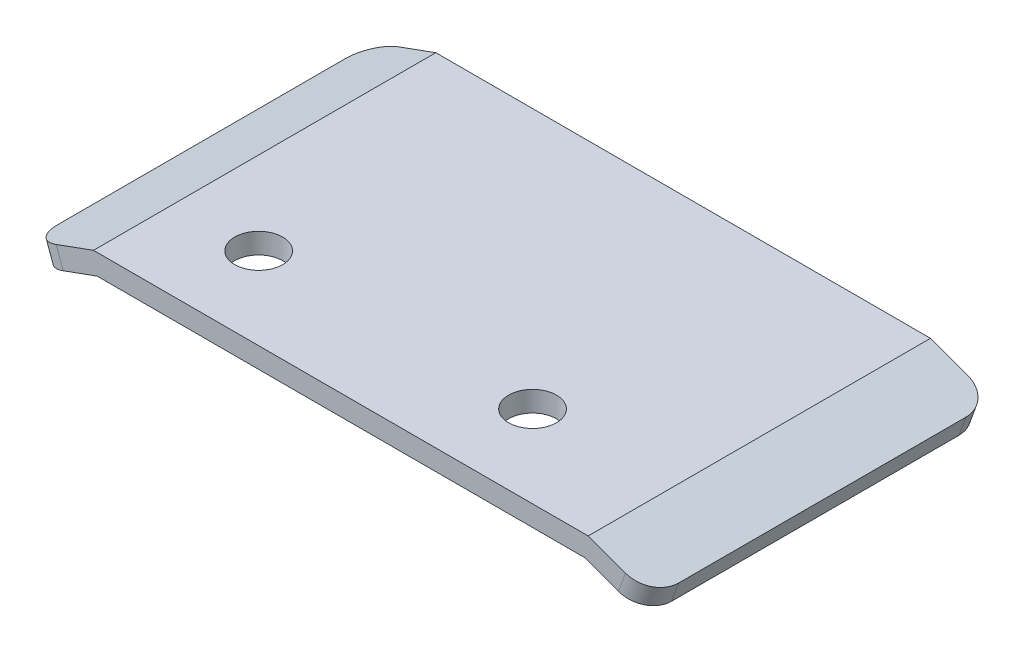
ISO-10303-21;
HEADER;
FILE_DESCRIPTION(('STEP AP214'),'2;1');
FILE_NAME('part.step','',(''),(''),'','','');
FILE_SCHEMA(('AUTOMOTIVE_DESIGN { 1 0 10303 214 1 1 1 1 }'));
ENDSEC;
DATA;
#1=APPLICATION_CONTEXT('core data for automotive mechanical design processes');
#2=APPLICATION_PROTOCOL_DEFINITION('international standard','automotive_design',2000,#1);
#3=PRODUCT_CONTEXT('',#1,'mechanical');
#4=PRODUCT('Part','Part','',(#3));
#5=PRODUCT_RELATED_PRODUCT_CATEGORY('part','',(#4));
#6=PRODUCT_DEFINITION_FORMATION('','',#4);
#7=PRODUCT_DEFINITION_CONTEXT('part definition',#1,'design');
#8=PRODUCT_DEFINITION('design','',#6,#7);
#9=PRODUCT_DEFINITION_SHAPE('','',#8);
#10=(LENGTH_UNIT() NAMED_UNIT(*) SI_UNIT(.MILLI.,.METRE.));
#11=(NAMED_UNIT(*) PLANE_ANGLE_UNIT() SI_UNIT($,.RADIAN.));
#12=(NAMED_UNIT(*) SI_UNIT($,.STERADIAN.) SOLID_ANGLE_UNIT());
#13=UNCERTAINTY_MEASURE_WITH_UNIT(LENGTH_MEASURE(1.E-05),#10,'distance_accuracy_value','');
#14=(GEOMETRIC_REPRESENTATION_CONTEXT(3) GLOBAL_UNCERTAINTY_ASSIGNED_CONTEXT((#13)) GLOBAL_UNIT_ASSIGNED_CONTEXT((#10,
#11,#12)) REPRESENTATION_CONTEXT('',''));
#15=CARTESIAN_POINT('',(0.,0.,0.));
#16=DIRECTION('',(0.,0.,1.));
#17=DIRECTION('',(1.,0.,0.));
#18=AXIS2_PLACEMENT_3D('',#15,#16,#17);
#19=CARTESIAN_POINT('',(-19.6015949538531,4.27295140546506,25.));
#20=DIRECTION('',(0.939692620785908,0.342020143325669,0.));
#21=DIRECTION('',(-0.342020143325669,0.939692620785908,0.));
#22=AXIS2_PLACEMENT_3D('',#19,#20,#21);
#23=PLANE('',#22);
#24=DIRECTION('',(0.,0.,-1.));
#25=VECTOR('',#24,1.);
#26=CARTESIAN_POINT('',(-19.6015949538531,4.27295140546506,25.));
#27=LINE('',#26,#25);
#28=CARTESIAN_POINT('',(-19.6015949538531,4.27295140546506,23.));
#29=VERTEX_POINT('',#28);
#30=CARTESIAN_POINT('',(-19.6015949538531,4.27295140546506,2.));
#31=VERTEX_POINT('',#30);
#32=EDGE_CURVE('E160',#29,#31,#27,.T.);
#33=ORIENTED_EDGE('',*,*,#32,.T.);
#34=DIRECTION('',(0.342020143325669,-0.939692620785908,0.));
#35=VECTOR('',#34,1.);
#36=CARTESIAN_POINT('',(-19.6015949538531,4.27295140546506,2.));
#37=LINE('',#36,#35);
#38=CARTESIAN_POINT('',(-19.0885647388646,2.8634124742862,2.));
#39=VERTEX_POINT('',#38);
#40=EDGE_CURVE('E210',#31,#39,#37,.T.);
#41=ORIENTED_EDGE('',*,*,#40,.T.);
#42=DIRECTION('',(0.,0.,-1.));
#43=VECTOR('',#42,1.);
#44=CARTESIAN_POINT('',(-19.0885647388646,2.8634124742862,25.));
#45=LINE('',#44,#43);
#46=CARTESIAN_POINT('',(-19.0885647388646,2.8634124742862,23.));
#47=VERTEX_POINT('',#46);
#48=EDGE_CURVE('E143',#47,#39,#45,.T.);
#49=ORIENTED_EDGE('',*,*,#48,.F.);
#50=DIRECTION('',(0.342020143325669,-0.939692620785908,0.));
#51=VECTOR('',#50,1.);
#52=CARTESIAN_POINT('',(-19.6015949538531,4.27295140546506,23.));
#53=LINE('',#52,#51);
#54=EDGE_CURVE('E53',#47,#29,#53,.F.);
#55=ORIENTED_EDGE('',*,*,#54,.T.);
#56=EDGE_LOOP('',(#33,#41,#49,#55));
#57=FACE_BOUND('',#56,.T.);
#58=ADVANCED_FACE('F33',(#57),#23,.F.);
#59=CARTESIAN_POINT('',(-19.0885647388646,2.8634124742862,25.));
#60=DIRECTION('',(-0.34202014332567,0.939692620785908,0.));
#61=DIRECTION('',(-0.939692620785908,-0.34202014332567,0.));
#62=AXIS2_PLACEMENT_3D('',#59,#60,#61);
#63=PLANE('',#62);
#64=ORIENTED_EDGE('',*,*,#48,.T.);
#65=CARTESIAN_POINT('',(-17.2091794972928,3.54745276093754,2.));
#66=DIRECTION('',(-0.34202014332567,0.939692620785908,0.));
#67=DIRECTION('',(-0.939692620785908,-0.34202014332567,0.));
#68=AXIS2_PLACEMENT_3D('',#65,#66,#67);
#69=CIRCLE('',#68,2.);
#70=CARTESIAN_POINT('',(-17.2091794972928,3.54745276093754,0.));
#71=VERTEX_POINT('',#70);
#72=EDGE_CURVE('E215',#39,#71,#69,.F.);
#73=ORIENTED_EDGE('',*,*,#72,.T.);
#74=DIRECTION('',(0.939692620785908,0.34202014332567,0.));
#75=VECTOR('',#74,1.);
#76=CARTESIAN_POINT('',(-19.0885647388646,2.8634124742862,0.));
#77=LINE('',#76,#75);
#78=CARTESIAN_POINT('',(-14.7326106409394,4.44885010776084,0.));
#79=VERTEX_POINT('',#78);
#80=EDGE_CURVE('E140',#71,#79,#77,.T.);
#81=ORIENTED_EDGE('',*,*,#80,.T.);
#82=DIRECTION('',(0.,0.,-1.));
#83=VECTOR('',#82,1.);
#84=CARTESIAN_POINT('',(-14.7326106409394,4.44885010776084,25.));
#85=LINE('',#84,#83);
#86=CARTESIAN_POINT('',(-14.7326106409394,4.44885010776084,25.));
#87=VERTEX_POINT('',#86);
#88=EDGE_CURVE('E136',#87,#79,#85,.T.);
#89=ORIENTED_EDGE('',*,*,#88,.F.);
#90=DIRECTION('',(0.939692620785908,0.34202014332567,0.));
#91=VECTOR('',#90,1.);
#92=CARTESIAN_POINT('',(-19.0885647388646,2.8634124742862,25.));
#93=LINE('',#92,#91);
#94=CARTESIAN_POINT('',(-17.2091794972928,3.54745276093754,25.));
#95=VERTEX_POINT('',#94);
#96=EDGE_CURVE('E122',#95,#87,#93,.T.);
#97=ORIENTED_EDGE('',*,*,#96,.F.);
#98=CARTESIAN_POINT('',(-17.2091794972928,3.54745276093754,23.));
#99=DIRECTION('',(-0.34202014332567,0.939692620785908,0.));
#100=DIRECTION('',(-0.939692620785908,-0.34202014332567,0.));
#101=AXIS2_PLACEMENT_3D('',#98,#99,#100);
#102=CIRCLE('',#101,2.);
#103=EDGE_CURVE('E213',#95,#47,#102,.F.);
#104=ORIENTED_EDGE('',*,*,#103,.T.);
#105=EDGE_LOOP('',(#64,#73,#81,#89,#97,#104));
#106=FACE_BOUND('',#105,.T.);
#107=ADVANCED_FACE('F138',(#106),#63,.F.);
#108=CARTESIAN_POINT('',(-14.7326106409394,4.44885010776084,25.));
#109=DIRECTION('',(0.,1.,0.));
#110=DIRECTION('',(-1.,0.,0.));
#111=AXIS2_PLACEMENT_3D('',#108,#109,#110);
#112=PLANE('',#111);
#113=CARTESIAN_POINT('',(11.0673893590606,4.44885010776085,19.));
#114=DIRECTION('',(0.,-1.,0.));
#115=DIRECTION('',(1.,0.,0.));
#116=AXIS2_PLACEMENT_3D('',#113,#114,#115);
#117=CIRCLE('',#116,1.75);
#118=CARTESIAN_POINT('',(12.8173893590606,4.44885010776085,19.));
#119=VERTEX_POINT('',#118);
#120=EDGE_CURVE('E391',#119,#119,#117,.T.);
#121=ORIENTED_EDGE('',*,*,#120,.F.);
#122=EDGE_LOOP('',(#121));
#123=FACE_BOUND('',#122,.T.);
#124=CARTESIAN_POINT('',(-8.93261064093942,4.44885010776084,19.));
#125=DIRECTION('',(0.,-1.,0.));
#126=DIRECTION('',(1.,0.,0.));
#127=AXIS2_PLACEMENT_3D('',#124,#125,#126);
#128=CIRCLE('',#127,1.75);
#129=CARTESIAN_POINT('',(-7.18261064093942,4.44885010776084,19.));
#130=VERTEX_POINT('',#129);
#131=EDGE_CURVE('E394',#130,#130,#128,.T.);
#132=ORIENTED_EDGE('',*,*,#131,.F.);
#133=EDGE_LOOP('',(#132));
#134=FACE_BOUND('',#133,.T.);
#135=DIRECTION('',(1.,0.,0.));
#136=VECTOR('',#135,1.);
#137=CARTESIAN_POINT('',(-14.7326106409394,4.44885010776084,0.));
#138=LINE('',#137,#136);
#139=CARTESIAN_POINT('',(20.8673893590606,4.44885010776085,0.));
#140=VERTEX_POINT('',#139);
#141=EDGE_CURVE('E162',#79,#140,#138,.T.);
#142=ORIENTED_EDGE('',*,*,#141,.T.);
#143=DIRECTION('',(0.,0.,-1.));
#144=VECTOR('',#143,1.);
#145=CARTESIAN_POINT('',(20.8673893590606,4.44885010776085,25.));
#146=LINE('',#145,#144);
#147=CARTESIAN_POINT('',(20.8673893590606,4.44885010776085,25.));
#148=VERTEX_POINT('',#147);
#149=EDGE_CURVE('E144',#148,#140,#146,.T.);
#150=ORIENTED_EDGE('',*,*,#149,.F.);
#151=DIRECTION('',(1.,0.,0.));
#152=VECTOR('',#151,1.);
#153=CARTESIAN_POINT('',(-14.7326106409394,4.44885010776084,25.));
#154=LINE('',#153,#152);
#155=EDGE_CURVE('E127',#87,#148,#154,.T.);
#156=ORIENTED_EDGE('',*,*,#155,.F.);
#157=ORIENTED_EDGE('',*,*,#88,.T.);
#158=EDGE_LOOP('',(#142,#150,#156,#157));
#159=FACE_BOUND('',#158,.T.);
#160=ADVANCED_FACE('F146',(#123,#134,#159),#112,.F.);
#161=CARTESIAN_POINT('',(20.8673893590606,4.44885010776085,25.));
#162=DIRECTION('',(0.34202014332567,0.939692620785908,0.));
#163=DIRECTION('',(-0.939692620785908,0.34202014332567,0.));
#164=AXIS2_PLACEMENT_3D('',#161,#162,#163);
#165=PLANE('',#164);
#166=DIRECTION('',(0.,0.,-1.));
#167=VECTOR('',#166,1.);
#168=CARTESIAN_POINT('',(25.2233434569857,2.8634124742862,25.));
#169=LINE('',#168,#167);
#170=CARTESIAN_POINT('',(25.2233434569857,2.8634124742862,23.));
#171=VERTEX_POINT('',#170);
#172=CARTESIAN_POINT('',(25.2233434569857,2.8634124742862,2.));
#173=VERTEX_POINT('',#172);
#174=EDGE_CURVE('E183',#171,#173,#169,.T.);
#175=ORIENTED_EDGE('',*,*,#174,.F.);
#176=CARTESIAN_POINT('',(23.3439582154139,3.54745276093754,23.));
#177=DIRECTION('',(0.34202014332567,0.939692620785908,0.));
#178=DIRECTION('',(-0.939692620785908,0.34202014332567,0.));
#179=AXIS2_PLACEMENT_3D('',#176,#177,#178);
#180=CIRCLE('',#179,2.);
#181=CARTESIAN_POINT('',(23.3439582154139,3.54745276093754,25.));
#182=VERTEX_POINT('',#181);
#183=EDGE_CURVE('E203',#171,#182,#180,.F.);
#184=ORIENTED_EDGE('',*,*,#183,.T.);
#185=DIRECTION('',(0.939692620785908,-0.34202014332567,0.));
#186=VECTOR('',#185,1.);
#187=CARTESIAN_POINT('',(20.8673893590606,4.44885010776085,25.));
#188=LINE('',#187,#186);
#189=EDGE_CURVE('E149',#148,#182,#188,.T.);
#190=ORIENTED_EDGE('',*,*,#189,.F.);
#191=ORIENTED_EDGE('',*,*,#149,.T.);
#192=DIRECTION('',(0.939692620785908,-0.34202014332567,0.));
#193=VECTOR('',#192,1.);
#194=CARTESIAN_POINT('',(20.8673893590606,4.44885010776085,0.));
#195=LINE('',#194,#193);
#196=CARTESIAN_POINT('',(23.3439582154139,3.54745276093754,0.));
#197=VERTEX_POINT('',#196);
#198=EDGE_CURVE('E165',#140,#197,#195,.T.);
#199=ORIENTED_EDGE('',*,*,#198,.T.);
#200=CARTESIAN_POINT('',(23.3439582154139,3.54745276093754,2.));
#201=DIRECTION('',(0.34202014332567,0.939692620785908,0.));
#202=DIRECTION('',(-0.939692620785908,0.34202014332567,0.));
#203=AXIS2_PLACEMENT_3D('',#200,#201,#202);
#204=CIRCLE('',#203,2.);
#205=EDGE_CURVE('E201',#197,#173,#204,.F.);
#206=ORIENTED_EDGE('',*,*,#205,.T.);
#207=EDGE_LOOP('',(#175,#184,#190,#191,#199,#206));
#208=FACE_BOUND('',#207,.T.);
#209=ADVANCED_FACE('F233',(#208),#165,.F.);
#210=CARTESIAN_POINT('',(25.7363736719742,4.27295140546506,25.));
#211=DIRECTION('',(-0.939692620785909,0.342020143325667,0.));
#212=DIRECTION('',(-0.342020143325667,-0.939692620785909,0.));
#213=AXIS2_PLACEMENT_3D('',#210,#211,#212);
#214=PLANE('',#213);
#215=DIRECTION('',(0.,0.,-1.));
#216=VECTOR('',#215,1.);
#217=CARTESIAN_POINT('',(25.7363736719742,4.27295140546506,25.));
#218=LINE('',#217,#216);
#219=CARTESIAN_POINT('',(25.7363736719742,4.27295140546506,23.));
#220=VERTEX_POINT('',#219);
#221=CARTESIAN_POINT('',(25.7363736719742,4.27295140546506,2.));
#222=VERTEX_POINT('',#221);
#223=EDGE_CURVE('E180',#220,#222,#218,.T.);
#224=ORIENTED_EDGE('',*,*,#223,.F.);
#225=DIRECTION('',(0.342020143325667,0.939692620785909,0.));
#226=VECTOR('',#225,1.);
#227=CARTESIAN_POINT('',(25.2233434569857,2.8634124742862,23.));
#228=LINE('',#227,#226);
#229=EDGE_CURVE('E199',#220,#171,#228,.F.);
#230=ORIENTED_EDGE('',*,*,#229,.T.);
#231=ORIENTED_EDGE('',*,*,#174,.T.);
#232=DIRECTION('',(0.342020143325667,0.939692620785909,0.));
#233=VECTOR('',#232,1.);
#234=CARTESIAN_POINT('',(25.7363736719742,4.27295140546506,2.));
#235=LINE('',#234,#233);
#236=EDGE_CURVE('E196',#173,#222,#235,.T.);
#237=ORIENTED_EDGE('',*,*,#236,.T.);
#238=EDGE_LOOP('',(#224,#230,#231,#237));
#239=FACE_BOUND('',#238,.T.);
#240=ADVANCED_FACE('F246',(#239),#214,.F.);
#241=CARTESIAN_POINT('',(21.1318798301233,5.94885010776085,25.));
#242=DIRECTION('',(-0.34202014332567,-0.939692620785908,0.));
#243=DIRECTION('',(0.939692620785908,-0.34202014332567,0.));
#244=AXIS2_PLACEMENT_3D('',#241,#242,#243);
#245=PLANE('',#244);
#246=DIRECTION('',(-0.939692620785908,0.34202014332567,0.));
#247=VECTOR('',#246,1.);
#248=CARTESIAN_POINT('',(21.1318798301233,5.94885010776085,25.));
#249=LINE('',#248,#247);
#250=CARTESIAN_POINT('',(23.8569884304024,4.9569916921164,25.));
#251=VERTEX_POINT('',#250);
#252=CARTESIAN_POINT('',(21.1318798301233,5.94885010776085,25.));
#253=VERTEX_POINT('',#252);
#254=EDGE_CURVE('E151',#251,#253,#249,.T.);
#255=ORIENTED_EDGE('',*,*,#254,.F.);
#256=CARTESIAN_POINT('',(23.8569884304024,4.9569916921164,23.));
#257=DIRECTION('',(-0.34202014332567,-0.939692620785908,0.));
#258=DIRECTION('',(0.939692620785908,-0.34202014332567,0.));
#259=AXIS2_PLACEMENT_3D('',#256,#257,#258);
#260=CIRCLE('',#259,2.);
#261=EDGE_CURVE('E194',#251,#220,#260,.F.);
#262=ORIENTED_EDGE('',*,*,#261,.T.);
#263=ORIENTED_EDGE('',*,*,#223,.T.);
#264=CARTESIAN_POINT('',(23.8569884304024,4.9569916921164,2.));
#265=DIRECTION('',(-0.34202014332567,-0.939692620785908,0.));
#266=DIRECTION('',(0.939692620785908,-0.34202014332567,0.));
#267=AXIS2_PLACEMENT_3D('',#264,#265,#266);
#268=CIRCLE('',#267,2.);
#269=CARTESIAN_POINT('',(23.8569884304024,4.9569916921164,0.));
#270=VERTEX_POINT('',#269);
#271=EDGE_CURVE('E192',#222,#270,#268,.F.);
#272=ORIENTED_EDGE('',*,*,#271,.T.);
#273=DIRECTION('',(-0.939692620785908,0.34202014332567,0.));
#274=VECTOR('',#273,1.);
#275=CARTESIAN_POINT('',(21.1318798301233,5.94885010776085,0.));
#276=LINE('',#275,#274);
#277=CARTESIAN_POINT('',(21.1318798301233,5.94885010776085,0.));
#278=VERTEX_POINT('',#277);
#279=EDGE_CURVE('E168',#270,#278,#276,.T.);
#280=ORIENTED_EDGE('',*,*,#279,.T.);
#281=DIRECTION('',(0.,0.,-1.));
#282=VECTOR('',#281,1.);
#283=CARTESIAN_POINT('',(21.1318798301233,5.94885010776085,25.));
#284=LINE('',#283,#282);
#285=EDGE_CURVE('E177',#253,#278,#284,.T.);
#286=ORIENTED_EDGE('',*,*,#285,.F.);
#287=EDGE_LOOP('',(#255,#262,#263,#272,#280,#286));
#288=FACE_BOUND('',#287,.T.);
#289=ADVANCED_FACE('F243',(#288),#245,.F.);
#290=CARTESIAN_POINT('',(-14.9971011120021,5.94885010776084,25.));
#291=DIRECTION('',(0.,-1.,0.));
#292=DIRECTION('',(1.,0.,0.));
#293=AXIS2_PLACEMENT_3D('',#290,#291,#292);
#294=PLANE('',#293);
#295=CARTESIAN_POINT('',(11.0673893590606,5.94885010776085,19.));
#296=DIRECTION('',(0.,-1.,0.));
#297=DIRECTION('',(1.,0.,0.));
#298=AXIS2_PLACEMENT_3D('',#295,#296,#297);
#299=CIRCLE('',#298,1.75);
#300=CARTESIAN_POINT('',(12.8173893590606,5.94885010776085,19.));
#301=VERTEX_POINT('',#300);
#302=EDGE_CURVE('E396',#301,#301,#299,.T.);
#303=ORIENTED_EDGE('',*,*,#302,.T.);
#304=EDGE_LOOP('',(#303));
#305=FACE_BOUND('',#304,.T.);
#306=CARTESIAN_POINT('',(-8.93261064093942,5.94885010776085,19.));
#307=DIRECTION('',(0.,-1.,0.));
#308=DIRECTION('',(1.,0.,0.));
#309=AXIS2_PLACEMENT_3D('',#306,#307,#308);
#310=CIRCLE('',#309,1.75);
#311=CARTESIAN_POINT('',(-7.18261064093942,5.94885010776085,19.));
#312=VERTEX_POINT('',#311);
#313=EDGE_CURVE('E163',#312,#312,#310,.T.);
#314=ORIENTED_EDGE('',*,*,#313,.T.);
#315=EDGE_LOOP('',(#314));
#316=FACE_BOUND('',#315,.T.);
#317=DIRECTION('',(-1.,0.,0.));
#318=VECTOR('',#317,1.);
#319=CARTESIAN_POINT('',(-14.9971011120021,5.94885010776084,0.));
#320=LINE('',#319,#318);
#321=CARTESIAN_POINT('',(-14.9971011120021,5.94885010776084,0.));
#322=VERTEX_POINT('',#321);
#323=EDGE_CURVE('E170',#278,#322,#320,.T.);
#324=ORIENTED_EDGE('',*,*,#323,.T.);
#325=DIRECTION('',(0.,0.,-1.));
#326=VECTOR('',#325,1.);
#327=CARTESIAN_POINT('',(-14.9971011120021,5.94885010776084,25.));
#328=LINE('',#327,#326);
#329=CARTESIAN_POINT('',(-14.9971011120021,5.94885010776084,25.));
#330=VERTEX_POINT('',#329);
#331=EDGE_CURVE('E174',#330,#322,#328,.T.);
#332=ORIENTED_EDGE('',*,*,#331,.F.);
#333=DIRECTION('',(-1.,0.,0.));
#334=VECTOR('',#333,1.);
#335=CARTESIAN_POINT('',(-14.9971011120021,5.94885010776084,25.));
#336=LINE('',#335,#334);
#337=EDGE_CURVE('E156',#253,#330,#336,.T.);
#338=ORIENTED_EDGE('',*,*,#337,.F.);
#339=ORIENTED_EDGE('',*,*,#285,.T.);
#340=EDGE_LOOP('',(#324,#332,#338,#339));
#341=FACE_BOUND('',#340,.T.);
#342=ADVANCED_FACE('F253',(#305,#316,#341),#294,.F.);
#343=CARTESIAN_POINT('',(-19.6015949538531,4.27295140546506,25.));
#344=DIRECTION('',(0.34202014332567,-0.939692620785908,0.));
#345=DIRECTION('',(0.939692620785908,0.34202014332567,0.));
#346=AXIS2_PLACEMENT_3D('',#343,#344,#345);
#347=PLANE('',#346);
#348=DIRECTION('',(-0.939692620785908,-0.34202014332567,0.));
#349=VECTOR('',#348,1.);
#350=CARTESIAN_POINT('',(-19.6015949538531,4.27295140546506,0.));
#351=LINE('',#350,#349);
#352=CARTESIAN_POINT('',(-17.7222097122813,4.9569916921164,0.));
#353=VERTEX_POINT('',#352);
#354=EDGE_CURVE('E133',#322,#353,#351,.T.);
#355=ORIENTED_EDGE('',*,*,#354,.T.);
#356=CARTESIAN_POINT('',(-17.7222097122813,4.9569916921164,2.));
#357=DIRECTION('',(0.34202014332567,-0.939692620785908,0.));
#358=DIRECTION('',(0.939692620785908,0.34202014332567,0.));
#359=AXIS2_PLACEMENT_3D('',#356,#357,#358);
#360=CIRCLE('',#359,2.);
#361=EDGE_CURVE('E11',#353,#31,#360,.F.);
#362=ORIENTED_EDGE('',*,*,#361,.T.);
#363=ORIENTED_EDGE('',*,*,#32,.F.);
#364=CARTESIAN_POINT('',(-17.7222097122813,4.9569916921164,23.));
#365=DIRECTION('',(0.34202014332567,-0.939692620785908,0.));
#366=DIRECTION('',(0.939692620785908,0.34202014332567,0.));
#367=AXIS2_PLACEMENT_3D('',#364,#365,#366);
#368=CIRCLE('',#367,2.);
#369=CARTESIAN_POINT('',(-17.7222097122813,4.9569916921164,25.));
#370=VERTEX_POINT('',#369);
#371=EDGE_CURVE('E41',#29,#370,#368,.F.);
#372=ORIENTED_EDGE('',*,*,#371,.T.);
#373=DIRECTION('',(-0.939692620785908,-0.34202014332567,0.));
#374=VECTOR('',#373,1.);
#375=CARTESIAN_POINT('',(-19.6015949538531,4.27295140546506,25.));
#376=LINE('',#375,#374);
#377=EDGE_CURVE('E158',#330,#370,#376,.T.);
#378=ORIENTED_EDGE('',*,*,#377,.F.);
#379=ORIENTED_EDGE('',*,*,#331,.T.);
#380=EDGE_LOOP('',(#355,#362,#363,#372,#378,#379));
#381=FACE_BOUND('',#380,.T.);
#382=ADVANCED_FACE('F218',(#381),#347,.F.);
#383=CARTESIAN_POINT('',(0.,0.,25.));
#384=DIRECTION('',(0.,0.,1.));
#385=DIRECTION('',(1.,0.,0.));
#386=AXIS2_PLACEMENT_3D('',#383,#384,#385);
#387=PLANE('',#386);
#388=ORIENTED_EDGE('',*,*,#189,.T.);
#389=DIRECTION('',(0.342020143325667,0.939692620785909,0.));
#390=VECTOR('',#389,1.);
#391=CARTESIAN_POINT('',(23.8569884304024,4.9569916921164,25.));
#392=LINE('',#391,#390);
#393=EDGE_CURVE('E189',#182,#251,#392,.T.);
#394=ORIENTED_EDGE('',*,*,#393,.T.);
#395=ORIENTED_EDGE('',*,*,#254,.T.);
#396=ORIENTED_EDGE('',*,*,#337,.T.);
#397=ORIENTED_EDGE('',*,*,#377,.T.);
#398=DIRECTION('',(0.342020143325669,-0.939692620785908,0.));
#399=VECTOR('',#398,1.);
#400=CARTESIAN_POINT('',(-17.2091794972928,3.54745276093754,25.));
#401=LINE('',#400,#399);
#402=EDGE_CURVE('E131',#370,#95,#401,.T.);
#403=ORIENTED_EDGE('',*,*,#402,.T.);
#404=ORIENTED_EDGE('',*,*,#96,.T.);
#405=ORIENTED_EDGE('',*,*,#155,.T.);
#406=EDGE_LOOP('',(#388,#394,#395,#396,#397,#403,#404,#405));
#407=FACE_BOUND('',#406,.T.);
#408=ADVANCED_FACE('F125',(#407),#387,.T.);
#409=CARTESIAN_POINT('',(0.,0.,0.));
#410=DIRECTION('',(0.,0.,1.));
#411=DIRECTION('',(1.,0.,0.));
#412=AXIS2_PLACEMENT_3D('',#409,#410,#411);
#413=PLANE('',#412);
#414=ORIENTED_EDGE('',*,*,#279,.F.);
#415=DIRECTION('',(0.342020143325667,0.939692620785909,0.));
#416=VECTOR('',#415,1.);
#417=CARTESIAN_POINT('',(19.4731045030272,-7.08763040785702,0.));
#418=LINE('',#417,#416);
#419=EDGE_CURVE('E207',#270,#197,#418,.F.);
#420=ORIENTED_EDGE('',*,*,#419,.T.);
#421=ORIENTED_EDGE('',*,*,#198,.F.);
#422=ORIENTED_EDGE('',*,*,#141,.F.);
#423=ORIENTED_EDGE('',*,*,#80,.F.);
#424=DIRECTION('',(0.342020143325669,-0.939692620785908,0.));
#425=VECTOR('',#424,1.);
#426=CARTESIAN_POINT('',(-14.055958570576,-5.11595053376858,0.));
#427=LINE('',#426,#425);
#428=EDGE_CURVE('E205',#71,#353,#427,.F.);
#429=ORIENTED_EDGE('',*,*,#428,.T.);
#430=ORIENTED_EDGE('',*,*,#354,.F.);
#431=ORIENTED_EDGE('',*,*,#323,.F.);
#432=EDGE_LOOP('',(#414,#420,#421,#422,#423,#429,#430,#431));
#433=FACE_BOUND('',#432,.T.);
#434=ADVANCED_FACE('F228',(#433),#413,.F.);
#435=CARTESIAN_POINT('',(-8.93261064093942,5.94885010776085,19.));
#436=DIRECTION('',(0.,-1.,0.));
#437=DIRECTION('',(1.,0.,0.));
#438=AXIS2_PLACEMENT_3D('',#435,#436,#437);
#439=CYLINDRICAL_SURFACE('',#438,1.75);
#440=ORIENTED_EDGE('',*,*,#313,.F.);
#441=EDGE_LOOP('',(#440));
#442=FACE_BOUND('',#441,.T.);
#443=ORIENTED_EDGE('',*,*,#131,.T.);
#444=EDGE_LOOP('',(#443));
#445=FACE_BOUND('',#444,.T.);
#446=ADVANCED_FACE('F310',(#442,#445),#439,.F.);
#447=CARTESIAN_POINT('',(11.0673893590606,5.94885010776085,19.));
#448=DIRECTION('',(0.,-1.,0.));
#449=DIRECTION('',(1.,0.,0.));
#450=AXIS2_PLACEMENT_3D('',#447,#448,#449);
#451=CYLINDRICAL_SURFACE('',#450,1.75);
#452=ORIENTED_EDGE('',*,*,#302,.F.);
#453=EDGE_LOOP('',(#452));
#454=FACE_BOUND('',#453,.T.);
#455=ORIENTED_EDGE('',*,*,#120,.T.);
#456=EDGE_LOOP('',(#455));
#457=FACE_BOUND('',#456,.T.);
#458=ADVANCED_FACE('F275',(#454,#457),#451,.F.);
#459=CARTESIAN_POINT('',(19.4731045030272,-7.08763040785702,23.));
#460=DIRECTION('',(-0.342020143325667,-0.939692620785909,0.));
#461=DIRECTION('',(0.939692620785909,-0.342020143325667,0.));
#462=AXIS2_PLACEMENT_3D('',#459,#460,#461);
#463=CYLINDRICAL_SURFACE('',#462,2.);
#464=ORIENTED_EDGE('',*,*,#183,.F.);
#465=ORIENTED_EDGE('',*,*,#229,.F.);
#466=ORIENTED_EDGE('',*,*,#261,.F.);
#467=ORIENTED_EDGE('',*,*,#393,.F.);
#468=EDGE_LOOP('',(#464,#465,#466,#467));
#469=FACE_BOUND('',#468,.T.);
#470=ADVANCED_FACE('F239',(#469),#463,.T.);
#471=CARTESIAN_POINT('',(23.8569884304024,4.9569916921164,2.));
#472=DIRECTION('',(0.342020143325667,0.939692620785909,0.));
#473=DIRECTION('',(-0.939692620785909,0.342020143325667,0.));
#474=AXIS2_PLACEMENT_3D('',#471,#472,#473);
#475=CYLINDRICAL_SURFACE('',#474,2.);
#476=ORIENTED_EDGE('',*,*,#205,.F.);
#477=ORIENTED_EDGE('',*,*,#419,.F.);
#478=ORIENTED_EDGE('',*,*,#271,.F.);
#479=ORIENTED_EDGE('',*,*,#236,.F.);
#480=EDGE_LOOP('',(#476,#477,#478,#479));
#481=FACE_BOUND('',#480,.T.);
#482=ADVANCED_FACE('F249',(#481),#475,.T.);
#483=CARTESIAN_POINT('',(-17.7222097122813,4.9569916921164,2.));
#484=DIRECTION('',(0.342020143325669,-0.939692620785908,0.));
#485=DIRECTION('',(0.939692620785908,0.342020143325669,0.));
#486=AXIS2_PLACEMENT_3D('',#483,#484,#485);
#487=CYLINDRICAL_SURFACE('',#486,2.);
#488=ORIENTED_EDGE('',*,*,#361,.F.);
#489=ORIENTED_EDGE('',*,*,#428,.F.);
#490=ORIENTED_EDGE('',*,*,#72,.F.);
#491=ORIENTED_EDGE('',*,*,#40,.F.);
#492=EDGE_LOOP('',(#488,#489,#490,#491));
#493=FACE_BOUND('',#492,.T.);
#494=ADVANCED_FACE('F224',(#493),#487,.T.);
#495=CARTESIAN_POINT('',(-14.055958570576,-5.11595053376858,23.));
#496=DIRECTION('',(-0.342020143325669,0.939692620785908,0.));
#497=DIRECTION('',(-0.939692620785908,-0.342020143325669,0.));
#498=AXIS2_PLACEMENT_3D('',#495,#496,#497);
#499=CYLINDRICAL_SURFACE('',#498,2.);
#500=ORIENTED_EDGE('',*,*,#371,.F.);
#501=ORIENTED_EDGE('',*,*,#54,.F.);
#502=ORIENTED_EDGE('',*,*,#103,.F.);
#503=ORIENTED_EDGE('',*,*,#402,.F.);
#504=EDGE_LOOP('',(#500,#501,#502,#503));
#505=FACE_BOUND('',#504,.T.);
#506=ADVANCED_FACE('F35',(#505),#499,.T.);
#507=CLOSED_SHELL('',(#58,#107,#160,#209,#240,#289,#342,#382,#408,#434,#446,#458,#470,#482,#494,#506));
#508=MANIFOLD_SOLID_BREP('B2',#507);
#509=ADVANCED_BREP_SHAPE_REPRESENTATION('',(#18,#508),#14);
#510=SHAPE_DEFINITION_REPRESENTATION(#9,#509);
ENDSEC;
END-ISO-10303-21;
